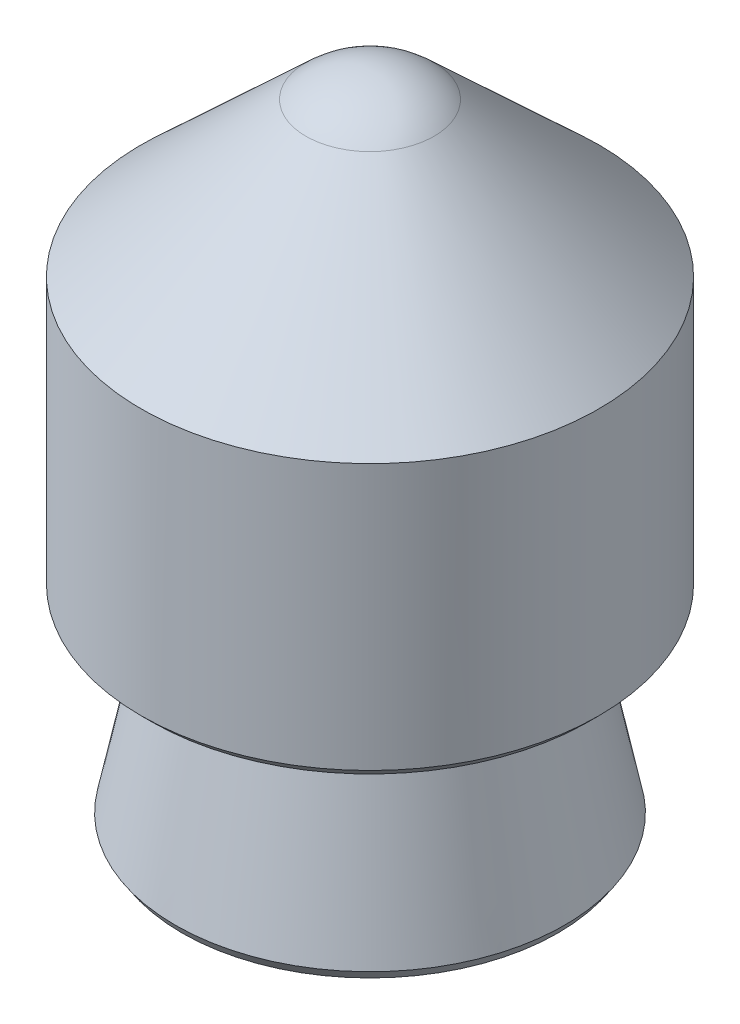
ISO-10303-21;
HEADER;
FILE_DESCRIPTION(('STEP AP214'),'2;1');
FILE_NAME('part.step','',(''),(''),'','','');
FILE_SCHEMA(('AUTOMOTIVE_DESIGN { 1 0 10303 214 1 1 1 1 }'));
ENDSEC;
DATA;
#1=APPLICATION_CONTEXT('core data for automotive mechanical design processes');
#2=APPLICATION_PROTOCOL_DEFINITION('international standard','automotive_design',2000,#1);
#3=PRODUCT_CONTEXT('',#1,'mechanical');
#4=PRODUCT('Part','Part','',(#3));
#5=PRODUCT_RELATED_PRODUCT_CATEGORY('part','',(#4));
#6=PRODUCT_DEFINITION_FORMATION('','',#4);
#7=PRODUCT_DEFINITION_CONTEXT('part definition',#1,'design');
#8=PRODUCT_DEFINITION('design','',#6,#7);
#9=PRODUCT_DEFINITION_SHAPE('','',#8);
#10=(LENGTH_UNIT() NAMED_UNIT(*) SI_UNIT(.MILLI.,.METRE.));
#11=(NAMED_UNIT(*) PLANE_ANGLE_UNIT() SI_UNIT($,.RADIAN.));
#12=(NAMED_UNIT(*) SI_UNIT($,.STERADIAN.) SOLID_ANGLE_UNIT());
#13=UNCERTAINTY_MEASURE_WITH_UNIT(LENGTH_MEASURE(1.E-05),#10,'distance_accuracy_value','');
#14=(GEOMETRIC_REPRESENTATION_CONTEXT(3) GLOBAL_UNCERTAINTY_ASSIGNED_CONTEXT((#13)) GLOBAL_UNIT_ASSIGNED_CONTEXT((#10,
#11,#12)) REPRESENTATION_CONTEXT('',''));
#15=CARTESIAN_POINT('',(0.,0.,0.));
#16=DIRECTION('',(0.,0.,1.));
#17=DIRECTION('',(1.,0.,0.));
#18=AXIS2_PLACEMENT_3D('',#15,#16,#17);
#19=CARTESIAN_POINT('',(0.,25.4,0.));
#20=DIRECTION('',(0.,1.,0.));
#21=DIRECTION('',(0.,0.,1.));
#22=AXIS2_PLACEMENT_3D('',#19,#20,#21);
#23=PLANE('',#22);
#24=CARTESIAN_POINT('',(0.,25.4,0.));
#25=DIRECTION('',(0.,-1.,0.));
#26=DIRECTION('',(0.,0.,-1.));
#27=AXIS2_PLACEMENT_3D('',#24,#25,#26);
#28=CIRCLE('',#27,3.5);
#29=CARTESIAN_POINT('',(0.,25.4,-3.5));
#30=VERTEX_POINT('',#29);
#31=EDGE_CURVE('E73',#30,#30,#28,.T.);
#32=ORIENTED_EDGE('',*,*,#31,.F.);
#33=EDGE_LOOP('',(#32));
#34=FACE_BOUND('',#33,.T.);
#35=CARTESIAN_POINT('',(0.,25.4,0.));
#36=DIRECTION('',(0.,1.,0.));
#37=DIRECTION('',(0.,0.,1.));
#38=AXIS2_PLACEMENT_3D('',#35,#36,#37);
#39=CIRCLE('',#38,4.59156114236063);
#40=CARTESIAN_POINT('',(0.,25.4,4.59156114236063));
#41=VERTEX_POINT('',#40);
#42=EDGE_CURVE('E58',#41,#41,#39,.F.);
#43=ORIENTED_EDGE('',*,*,#42,.T.);
#44=EDGE_LOOP('',(#43));
#45=FACE_BOUND('',#44,.T.);
#46=ADVANCED_FACE('F50',(#34,#45),#23,.F.);
#47=CARTESIAN_POINT('',(0.,30.2387,0.));
#48=DIRECTION('',(0.,-1.,0.));
#49=DIRECTION('',(0.,0.,-1.));
#50=AXIS2_PLACEMENT_3D('',#47,#48,#49);
#51=CONICAL_SURFACE('',#50,3.8227,0.200674236626133);
#52=CARTESIAN_POINT('',(0.,25.6489028308561,0.));
#53=DIRECTION('',(0.,1.,0.));
#54=DIRECTION('',(0.,0.,1.));
#55=AXIS2_PLACEMENT_3D('',#52,#53,#54);
#56=CIRCLE('',#55,4.75632015907782);
#57=CARTESIAN_POINT('',(0.,25.6489028308561,4.75632015907782));
#58=VERTEX_POINT('',#57);
#59=EDGE_CURVE('E13',#58,#58,#56,.T.);
#60=ORIENTED_EDGE('',*,*,#59,.T.);
#61=EDGE_LOOP('',(#60));
#62=FACE_BOUND('',#61,.T.);
#63=CARTESIAN_POINT('',(0.,30.2387,0.));
#64=DIRECTION('',(0.,-1.,0.));
#65=DIRECTION('',(0.,0.,-1.));
#66=AXIS2_PLACEMENT_3D('',#63,#64,#65);
#67=CIRCLE('',#66,3.8227);
#68=CARTESIAN_POINT('',(0.,30.2387,-3.8227));
#69=VERTEX_POINT('',#68);
#70=EDGE_CURVE('E86',#69,#69,#67,.T.);
#71=ORIENTED_EDGE('',*,*,#70,.T.);
#72=EDGE_LOOP('',(#71));
#73=FACE_BOUND('',#72,.T.);
#74=ADVANCED_FACE('F113',(#62,#73),#51,.T.);
#75=CARTESIAN_POINT('',(-3.8227,30.2387,0.));
#76=DIRECTION('',(0.,1.,0.));
#77=DIRECTION('',(0.,0.,1.));
#78=AXIS2_PLACEMENT_3D('',#75,#76,#77);
#79=PLANE('',#78);
#80=CARTESIAN_POINT('',(0.,30.2387,0.));
#81=DIRECTION('',(0.,1.,0.));
#82=DIRECTION('',(0.,0.,1.));
#83=AXIS2_PLACEMENT_3D('',#80,#81,#82);
#84=CIRCLE('',#83,5.334);
#85=CARTESIAN_POINT('',(0.,30.2387,5.334));
#86=VERTEX_POINT('',#85);
#87=EDGE_CURVE('E89',#86,#86,#84,.F.);
#88=ORIENTED_EDGE('',*,*,#87,.T.);
#89=EDGE_LOOP('',(#88));
#90=FACE_BOUND('',#89,.T.);
#91=ORIENTED_EDGE('',*,*,#70,.F.);
#92=EDGE_LOOP('',(#91));
#93=FACE_BOUND('',#92,.T.);
#94=ADVANCED_FACE('F119',(#90,#93),#79,.F.);
#95=CARTESIAN_POINT('',(0.,25.4,0.));
#96=DIRECTION('',(0.,-1.,0.));
#97=DIRECTION('',(0.,0.,-1.));
#98=AXIS2_PLACEMENT_3D('',#95,#96,#97);
#99=CYLINDRICAL_SURFACE('',#98,5.588);
#100=CARTESIAN_POINT('',(0.,30.4927,0.));
#101=DIRECTION('',(0.,1.,0.));
#102=DIRECTION('',(0.,0.,1.));
#103=AXIS2_PLACEMENT_3D('',#100,#101,#102);
#104=CIRCLE('',#103,5.588);
#105=CARTESIAN_POINT('',(0.,30.4927,5.588));
#106=VERTEX_POINT('',#105);
#107=EDGE_CURVE('E92',#106,#106,#104,.T.);
#108=ORIENTED_EDGE('',*,*,#107,.T.);
#109=EDGE_LOOP('',(#108));
#110=FACE_BOUND('',#109,.T.);
#111=CARTESIAN_POINT('',(0.,36.9824,0.));
#112=DIRECTION('',(0.,-1.,0.));
#113=DIRECTION('',(0.,0.,-1.));
#114=AXIS2_PLACEMENT_3D('',#111,#112,#113);
#115=CIRCLE('',#114,5.588);
#116=CARTESIAN_POINT('',(0.,36.9824,-5.588));
#117=VERTEX_POINT('',#116);
#118=EDGE_CURVE('E83',#117,#117,#115,.T.);
#119=ORIENTED_EDGE('',*,*,#118,.T.);
#120=EDGE_LOOP('',(#119));
#121=FACE_BOUND('',#120,.T.);
#122=ADVANCED_FACE('F126',(#110,#121),#99,.T.);
#123=CARTESIAN_POINT('',(0.,40.7353792951679,0.));
#124=DIRECTION('',(0.,-1.,0.));
#125=DIRECTION('',(0.,0.,-1.));
#126=AXIS2_PLACEMENT_3D('',#123,#124,#125);
#127=CONICAL_SURFACE('',#126,1.56336753354535,0.820311552481936);
#128=ORIENTED_EDGE('',*,*,#118,.F.);
#129=EDGE_LOOP('',(#128));
#130=FACE_BOUND('',#129,.T.);
#131=CARTESIAN_POINT('',(0.,40.7353792951679,0.));
#132=DIRECTION('',(0.,-1.,0.));
#133=DIRECTION('',(0.,0.,-1.));
#134=AXIS2_PLACEMENT_3D('',#131,#132,#133);
#135=CIRCLE('',#134,1.56336753354535);
#136=CARTESIAN_POINT('',(0.,40.7353792951679,-1.56336753354535));
#137=VERTEX_POINT('',#136);
#138=EDGE_CURVE('E78',#137,#137,#135,.T.);
#139=ORIENTED_EDGE('',*,*,#138,.T.);
#140=EDGE_LOOP('',(#139));
#141=FACE_BOUND('',#140,.T.);
#142=ADVANCED_FACE('F130',(#130,#141),#127,.T.);
#143=CARTESIAN_POINT('',(0.,39.05885,0.));
#144=DIRECTION('',(0.,-1.,0.));
#145=DIRECTION('',(-1.,0.,0.));
#146=AXIS2_PLACEMENT_3D('',#143,#144,#145);
#147=SPHERICAL_SURFACE('',#146,2.29235);
#148=ORIENTED_EDGE('',*,*,#138,.F.);
#149=EDGE_LOOP('',(#148));
#150=FACE_BOUND('',#149,.T.);
#151=ADVANCED_FACE('F109',(#150),#147,.T.);
#152=CARTESIAN_POINT('',(0.,30.2387,0.));
#153=DIRECTION('',(0.,1.,0.));
#154=DIRECTION('',(0.,0.,1.));
#155=AXIS2_PLACEMENT_3D('',#152,#153,#154);
#156=CONICAL_SURFACE('',#155,5.334,0.785398163397443);
#157=ORIENTED_EDGE('',*,*,#107,.F.);
#158=EDGE_LOOP('',(#157));
#159=FACE_BOUND('',#158,.T.);
#160=ORIENTED_EDGE('',*,*,#87,.F.);
#161=EDGE_LOOP('',(#160));
#162=FACE_BOUND('',#161,.T.);
#163=ADVANCED_FACE('F101',(#159,#162),#156,.T.);
#164=CARTESIAN_POINT('',(0.,25.4,0.));
#165=DIRECTION('',(0.,1.,0.));
#166=DIRECTION('',(0.,0.,1.));
#167=AXIS2_PLACEMENT_3D('',#164,#165,#166);
#168=CONICAL_SURFACE('',#167,4.59156114236063,0.584723926771309);
#169=ORIENTED_EDGE('',*,*,#59,.F.);
#170=EDGE_LOOP('',(#169));
#171=FACE_BOUND('',#170,.T.);
#172=ORIENTED_EDGE('',*,*,#42,.F.);
#173=EDGE_LOOP('',(#172));
#174=FACE_BOUND('',#173,.T.);
#175=ADVANCED_FACE('F52',(#171,#174),#168,.T.);
#176=CARTESIAN_POINT('',(0.,27.9,0.));
#177=DIRECTION('',(0.,-1.,0.));
#178=DIRECTION('',(0.,0.,-1.));
#179=AXIS2_PLACEMENT_3D('',#176,#177,#178);
#180=CYLINDRICAL_SURFACE('',#179,3.5);
#181=CARTESIAN_POINT('',(0.,27.9,0.));
#182=DIRECTION('',(0.,-1.,0.));
#183=DIRECTION('',(0.,0.,-1.));
#184=AXIS2_PLACEMENT_3D('',#181,#182,#183);
#185=CIRCLE('',#184,3.5);
#186=CARTESIAN_POINT('',(0.,27.9,-3.5));
#187=VERTEX_POINT('',#186);
#188=EDGE_CURVE('E75',#187,#187,#185,.T.);
#189=ORIENTED_EDGE('',*,*,#188,.F.);
#190=EDGE_LOOP('',(#189));
#191=FACE_BOUND('',#190,.T.);
#192=ORIENTED_EDGE('',*,*,#31,.T.);
#193=EDGE_LOOP('',(#192));
#194=FACE_BOUND('',#193,.T.);
#195=ADVANCED_FACE('F100',(#191,#194),#180,.F.);
#196=CARTESIAN_POINT('',(0.,27.9,0.));
#197=DIRECTION('',(0.,-1.,0.));
#198=DIRECTION('',(0.,0.,-1.));
#199=AXIS2_PLACEMENT_3D('',#196,#197,#198);
#200=PLANE('',#199);
#201=CARTESIAN_POINT('',(0.,27.9,0.));
#202=DIRECTION('',(0.,-1.,0.));
#203=DIRECTION('',(0.,0.,-1.));
#204=AXIS2_PLACEMENT_3D('',#201,#202,#203);
#205=CIRCLE('',#204,2.99999999999999);
#206=CARTESIAN_POINT('',(0.,27.9,-2.99999999999999));
#207=VERTEX_POINT('',#206);
#208=EDGE_CURVE('E54',#207,#207,#205,.T.);
#209=ORIENTED_EDGE('',*,*,#208,.F.);
#210=EDGE_LOOP('',(#209));
#211=FACE_BOUND('',#210,.T.);
#212=ORIENTED_EDGE('',*,*,#188,.T.);
#213=EDGE_LOOP('',(#212));
#214=FACE_BOUND('',#213,.T.);
#215=ADVANCED_FACE('F65',(#211,#214),#200,.T.);
#216=CARTESIAN_POINT('',(0.,36.354004,0.));
#217=DIRECTION('',(0.,-1.,0.));
#218=DIRECTION('',(0.,0.,-1.));
#219=AXIS2_PLACEMENT_3D('',#216,#217,#218);
#220=CONICAL_SURFACE('',#219,3.,1.02974425867665);
#221=CARTESIAN_POINT('',(0.,38.1565858570827,0.));
#222=VERTEX_POINT('',#221);
#223=VERTEX_LOOP('',#222);
#224=FACE_BOUND('',#223,.T.);
#225=CARTESIAN_POINT('',(0.,36.354004,0.));
#226=DIRECTION('',(0.,-1.,0.));
#227=DIRECTION('',(0.,0.,-1.));
#228=AXIS2_PLACEMENT_3D('',#225,#226,#227);
#229=CIRCLE('',#228,3.);
#230=CARTESIAN_POINT('',(0.,36.354004,-3.));
#231=VERTEX_POINT('',#230);
#232=EDGE_CURVE('E69',#231,#231,#229,.T.);
#233=ORIENTED_EDGE('',*,*,#232,.T.);
#234=EDGE_LOOP('',(#233));
#235=FACE_BOUND('',#234,.T.);
#236=ADVANCED_FACE('F61',(#224,#235),#220,.F.);
#237=CARTESIAN_POINT('',(0.,25.4,0.));
#238=DIRECTION('',(0.,-1.,0.));
#239=DIRECTION('',(0.,0.,-1.));
#240=AXIS2_PLACEMENT_3D('',#237,#238,#239);
#241=CYLINDRICAL_SURFACE('',#240,2.99999999999999);
#242=ORIENTED_EDGE('',*,*,#208,.T.);
#243=EDGE_LOOP('',(#242));
#244=FACE_BOUND('',#243,.T.);
#245=ORIENTED_EDGE('',*,*,#232,.F.);
#246=EDGE_LOOP('',(#245));
#247=FACE_BOUND('',#246,.T.);
#248=ADVANCED_FACE('F64',(#244,#247),#241,.F.);
#249=CLOSED_SHELL('',(#46,#74,#94,#122,#142,#151,#163,#175,#195,#215,#236,#248));
#250=MANIFOLD_SOLID_BREP('B2',#249);
#251=ADVANCED_BREP_SHAPE_REPRESENTATION('',(#18,#250),#14);
#252=SHAPE_DEFINITION_REPRESENTATION(#9,#251);
ENDSEC;
END-ISO-10303-21;
